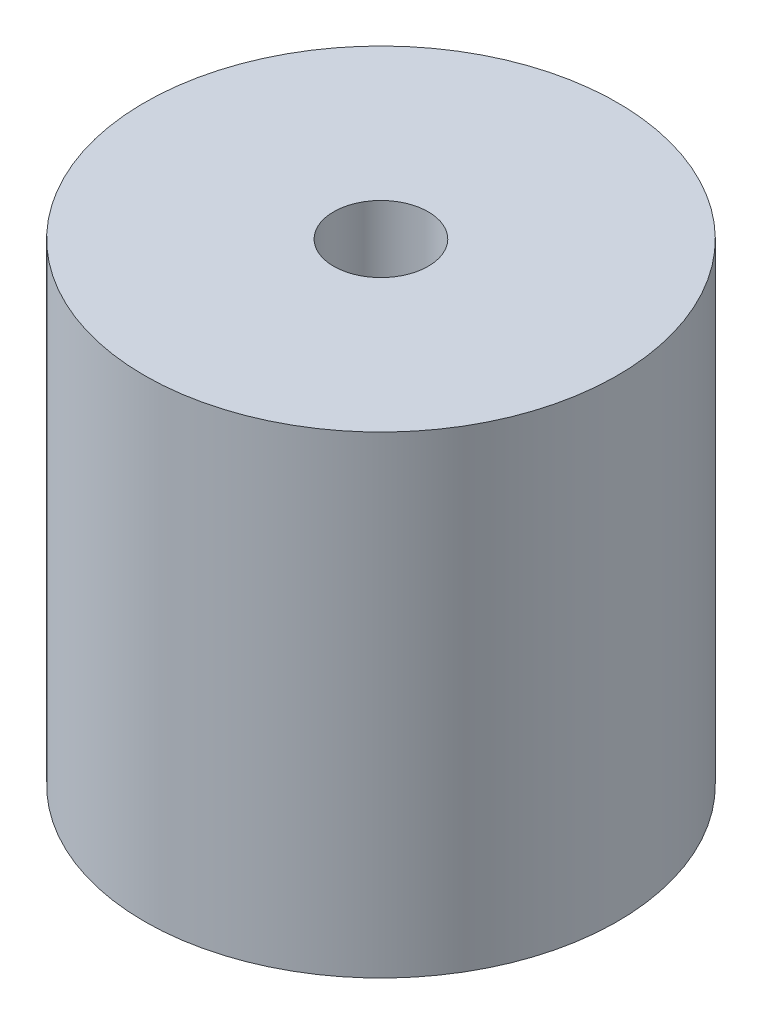
ISO-10303-21;
HEADER;
FILE_DESCRIPTION(('STEP AP214'),'2;1');
FILE_NAME('part.step','',(''),(''),'','','');
FILE_SCHEMA(('AUTOMOTIVE_DESIGN { 1 0 10303 214 1 1 1 1 }'));
ENDSEC;
DATA;
#1=APPLICATION_CONTEXT('core data for automotive mechanical design processes');
#2=APPLICATION_PROTOCOL_DEFINITION('international standard','automotive_design',2000,#1);
#3=PRODUCT_CONTEXT('',#1,'mechanical');
#4=PRODUCT('Part','Part','',(#3));
#5=PRODUCT_RELATED_PRODUCT_CATEGORY('part','',(#4));
#6=PRODUCT_DEFINITION_FORMATION('','',#4);
#7=PRODUCT_DEFINITION_CONTEXT('part definition',#1,'design');
#8=PRODUCT_DEFINITION('design','',#6,#7);
#9=PRODUCT_DEFINITION_SHAPE('','',#8);
#10=(LENGTH_UNIT() NAMED_UNIT(*) SI_UNIT(.MILLI.,.METRE.));
#11=(NAMED_UNIT(*) PLANE_ANGLE_UNIT() SI_UNIT($,.RADIAN.));
#12=(NAMED_UNIT(*) SI_UNIT($,.STERADIAN.) SOLID_ANGLE_UNIT());
#13=UNCERTAINTY_MEASURE_WITH_UNIT(LENGTH_MEASURE(1.E-05),#10,'distance_accuracy_value','');
#14=(GEOMETRIC_REPRESENTATION_CONTEXT(3) GLOBAL_UNCERTAINTY_ASSIGNED_CONTEXT((#13)) GLOBAL_UNIT_ASSIGNED_CONTEXT((#10,
#11,#12)) REPRESENTATION_CONTEXT('',''));
#15=CARTESIAN_POINT('',(0.,0.,0.));
#16=DIRECTION('',(0.,0.,1.));
#17=DIRECTION('',(1.,0.,0.));
#18=AXIS2_PLACEMENT_3D('',#15,#16,#17);
#19=CARTESIAN_POINT('',(0.,20.,0.));
#20=DIRECTION('',(0.,-1.,0.));
#21=DIRECTION('',(0.,0.,-1.));
#22=AXIS2_PLACEMENT_3D('',#19,#20,#21);
#23=CYLINDRICAL_SURFACE('',#22,10.);
#24=CARTESIAN_POINT('',(0.,20.,0.));
#25=DIRECTION('',(0.,1.,0.));
#26=DIRECTION('',(0.,0.,1.));
#27=AXIS2_PLACEMENT_3D('',#24,#25,#26);
#28=CIRCLE('',#27,10.);
#29=CARTESIAN_POINT('',(0.,20.,10.));
#30=VERTEX_POINT('',#29);
#31=EDGE_CURVE('E10',#30,#30,#28,.T.);
#32=ORIENTED_EDGE('',*,*,#31,.F.);
#33=EDGE_LOOP('',(#32));
#34=FACE_BOUND('',#33,.T.);
#35=CARTESIAN_POINT('',(0.,0.,0.));
#36=DIRECTION('',(0.,1.,0.));
#37=DIRECTION('',(0.,0.,1.));
#38=AXIS2_PLACEMENT_3D('',#35,#36,#37);
#39=CIRCLE('',#38,10.);
#40=CARTESIAN_POINT('',(0.,0.,10.));
#41=VERTEX_POINT('',#40);
#42=EDGE_CURVE('E35',#41,#41,#39,.T.);
#43=ORIENTED_EDGE('',*,*,#42,.T.);
#44=EDGE_LOOP('',(#43));
#45=FACE_BOUND('',#44,.T.);
#46=ADVANCED_FACE('F32',(#34,#45),#23,.T.);
#47=CARTESIAN_POINT('',(0.,20.,0.));
#48=DIRECTION('',(0.,1.,0.));
#49=DIRECTION('',(0.,0.,1.));
#50=AXIS2_PLACEMENT_3D('',#47,#48,#49);
#51=PLANE('',#50);
#52=CARTESIAN_POINT('',(0.,20.,0.));
#53=DIRECTION('',(0.,1.,0.));
#54=DIRECTION('',(0.,0.,1.));
#55=AXIS2_PLACEMENT_3D('',#52,#53,#54);
#56=CIRCLE('',#55,2.);
#57=CARTESIAN_POINT('',(0.,20.,2.));
#58=VERTEX_POINT('',#57);
#59=EDGE_CURVE('E44',#58,#58,#56,.T.);
#60=ORIENTED_EDGE('',*,*,#59,.F.);
#61=EDGE_LOOP('',(#60));
#62=FACE_BOUND('',#61,.T.);
#63=ORIENTED_EDGE('',*,*,#31,.T.);
#64=EDGE_LOOP('',(#63));
#65=FACE_BOUND('',#64,.T.);
#66=ADVANCED_FACE('F59',(#62,#65),#51,.T.);
#67=CARTESIAN_POINT('',(0.,0.,0.));
#68=DIRECTION('',(0.,1.,0.));
#69=DIRECTION('',(0.,0.,1.));
#70=AXIS2_PLACEMENT_3D('',#67,#68,#69);
#71=PLANE('',#70);
#72=ORIENTED_EDGE('',*,*,#42,.F.);
#73=EDGE_LOOP('',(#72));
#74=FACE_BOUND('',#73,.T.);
#75=ADVANCED_FACE('F55',(#74),#71,.F.);
#76=CARTESIAN_POINT('',(0.,10.,0.));
#77=DIRECTION('',(0.,1.,0.));
#78=DIRECTION('',(0.,0.,1.));
#79=AXIS2_PLACEMENT_3D('',#76,#77,#78);
#80=CYLINDRICAL_SURFACE('',#79,2.);
#81=CARTESIAN_POINT('',(0.,10.,0.));
#82=DIRECTION('',(0.,1.,0.));
#83=DIRECTION('',(0.,0.,1.));
#84=AXIS2_PLACEMENT_3D('',#81,#82,#83);
#85=CIRCLE('',#84,2.);
#86=CARTESIAN_POINT('',(0.,10.,2.));
#87=VERTEX_POINT('',#86);
#88=EDGE_CURVE('E42',#87,#87,#85,.T.);
#89=ORIENTED_EDGE('',*,*,#88,.F.);
#90=EDGE_LOOP('',(#89));
#91=FACE_BOUND('',#90,.T.);
#92=ORIENTED_EDGE('',*,*,#59,.T.);
#93=EDGE_LOOP('',(#92));
#94=FACE_BOUND('',#93,.T.);
#95=ADVANCED_FACE('F52',(#91,#94),#80,.F.);
#96=CARTESIAN_POINT('',(0.,10.,0.));
#97=DIRECTION('',(0.,1.,0.));
#98=DIRECTION('',(0.,0.,1.));
#99=AXIS2_PLACEMENT_3D('',#96,#97,#98);
#100=PLANE('',#99);
#101=ORIENTED_EDGE('',*,*,#88,.T.);
#102=EDGE_LOOP('',(#101));
#103=FACE_BOUND('',#102,.T.);
#104=ADVANCED_FACE('F50',(#103),#100,.T.);
#105=CLOSED_SHELL('',(#46,#66,#75,#95,#104));
#106=MANIFOLD_SOLID_BREP('B2',#105);
#107=ADVANCED_BREP_SHAPE_REPRESENTATION('',(#18,#106),#14);
#108=SHAPE_DEFINITION_REPRESENTATION(#9,#107);
ENDSEC;
END-ISO-10303-21;
